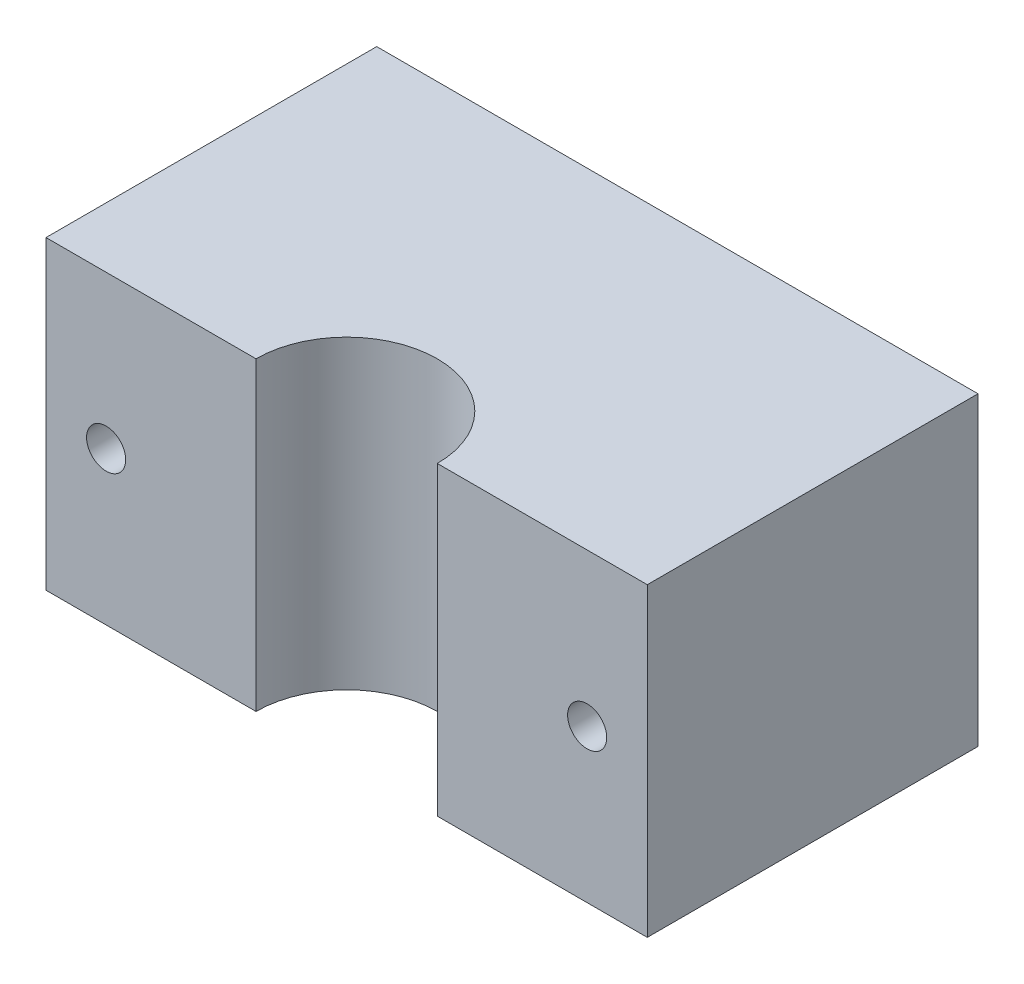
ISO-10303-21;
HEADER;
FILE_DESCRIPTION(('STEP AP214'),'2;1');
FILE_NAME('part.step','',(''),(''),'','','');
FILE_SCHEMA(('AUTOMOTIVE_DESIGN { 1 0 10303 214 1 1 1 1 }'));
ENDSEC;
DATA;
#1=APPLICATION_CONTEXT('core data for automotive mechanical design processes');
#2=APPLICATION_PROTOCOL_DEFINITION('international standard','automotive_design',2000,#1);
#3=PRODUCT_CONTEXT('',#1,'mechanical');
#4=PRODUCT('Part','Part','',(#3));
#5=PRODUCT_RELATED_PRODUCT_CATEGORY('part','',(#4));
#6=PRODUCT_DEFINITION_FORMATION('','',#4);
#7=PRODUCT_DEFINITION_CONTEXT('part definition',#1,'design');
#8=PRODUCT_DEFINITION('design','',#6,#7);
#9=PRODUCT_DEFINITION_SHAPE('','',#8);
#10=(LENGTH_UNIT() NAMED_UNIT(*) SI_UNIT(.MILLI.,.METRE.));
#11=(NAMED_UNIT(*) PLANE_ANGLE_UNIT() SI_UNIT($,.RADIAN.));
#12=(NAMED_UNIT(*) SI_UNIT($,.STERADIAN.) SOLID_ANGLE_UNIT());
#13=UNCERTAINTY_MEASURE_WITH_UNIT(LENGTH_MEASURE(1.E-05),#10,'distance_accuracy_value','');
#14=(GEOMETRIC_REPRESENTATION_CONTEXT(3) GLOBAL_UNCERTAINTY_ASSIGNED_CONTEXT((#13)) GLOBAL_UNIT_ASSIGNED_CONTEXT((#10,
#11,#12)) REPRESENTATION_CONTEXT('',''));
#15=CARTESIAN_POINT('',(0.,0.,0.));
#16=DIRECTION('',(0.,0.,1.));
#17=DIRECTION('',(1.,0.,0.));
#18=AXIS2_PLACEMENT_3D('',#15,#16,#17);
#19=CARTESIAN_POINT('',(64.4387499824699,0.,109.99999999995));
#20=DIRECTION('',(0.,0.,1.));
#21=DIRECTION('',(1.,0.,0.));
#22=AXIS2_PLACEMENT_3D('',#19,#20,#21);
#23=PLANE('',#22);
#24=CARTESIAN_POINT('',(80.,0.,109.99999999995));
#25=DIRECTION('',(0.,0.,-1.));
#26=DIRECTION('',(-1.,0.,0.));
#27=AXIS2_PLACEMENT_3D('',#24,#25,#26);
#28=CIRCLE('',#27,6.5);
#29=CARTESIAN_POINT('',(73.5,0.,109.99999999995));
#30=VERTEX_POINT('',#29);
#31=EDGE_CURVE('E121',#30,#30,#28,.T.);
#32=ORIENTED_EDGE('',*,*,#31,.T.);
#33=EDGE_LOOP('',(#32));
#34=FACE_BOUND('',#33,.T.);
#35=DIRECTION('',(1.,0.,0.));
#36=VECTOR('',#35,1.);
#37=CARTESIAN_POINT('',(-24.4387499824699,50.8,109.99999999995));
#38=LINE('',#37,#36);
#39=CARTESIAN_POINT('',(30.15,50.8,109.999999999949));
#40=VERTEX_POINT('',#39);
#41=CARTESIAN_POINT('',(100.,50.8,109.999999999951));
#42=VERTEX_POINT('',#41);
#43=EDGE_CURVE('E95',#40,#42,#38,.T.);
#44=ORIENTED_EDGE('',*,*,#43,.F.);
#45=DIRECTION('',(0.,1.,0.));
#46=VECTOR('',#45,1.);
#47=CARTESIAN_POINT('',(30.15,-684.295658325961,109.999999999951));
#48=LINE('',#47,#46);
#49=CARTESIAN_POINT('',(30.15,-50.8,109.999999999951));
#50=VERTEX_POINT('',#49);
#51=EDGE_CURVE('E37',#50,#40,#48,.T.);
#52=ORIENTED_EDGE('',*,*,#51,.F.);
#53=DIRECTION('',(-1.,0.,0.));
#54=VECTOR('',#53,1.);
#55=CARTESIAN_POINT('',(-24.4387499824699,-50.8,109.99999999995));
#56=LINE('',#55,#54);
#57=CARTESIAN_POINT('',(100.,-50.8,109.999999999951));
#58=VERTEX_POINT('',#57);
#59=EDGE_CURVE('E161',#58,#50,#56,.T.);
#60=ORIENTED_EDGE('',*,*,#59,.F.);
#61=DIRECTION('',(0.,-1.,0.));
#62=VECTOR('',#61,1.);
#63=CARTESIAN_POINT('',(100.,0.,109.999999999951));
#64=LINE('',#63,#62);
#65=EDGE_CURVE('E28',#42,#58,#64,.T.);
#66=ORIENTED_EDGE('',*,*,#65,.F.);
#67=EDGE_LOOP('',(#44,#52,#60,#66));
#68=FACE_BOUND('',#67,.T.);
#69=ADVANCED_FACE('F18',(#34,#68),#23,.T.);
#70=CARTESIAN_POINT('',(-80.,0.,109.999999999951));
#71=DIRECTION('',(0.,0.,-1.));
#72=DIRECTION('',(-1.,0.,0.));
#73=AXIS2_PLACEMENT_3D('',#70,#71,#72);
#74=CIRCLE('',#73,6.5);
#75=CARTESIAN_POINT('',(-86.5,0.,109.999999999951));
#76=VERTEX_POINT('',#75);
#77=EDGE_CURVE('E120',#76,#76,#74,.T.);
#78=ORIENTED_EDGE('',*,*,#77,.T.);
#79=EDGE_LOOP('',(#78));
#80=FACE_BOUND('',#79,.T.);
#81=CARTESIAN_POINT('',(-30.15,-50.8,109.99999999995));
#82=VERTEX_POINT('',#81);
#83=CARTESIAN_POINT('',(-100.,-50.8,109.999999999951));
#84=VERTEX_POINT('',#83);
#85=EDGE_CURVE('E89',#82,#84,#56,.T.);
#86=ORIENTED_EDGE('',*,*,#85,.F.);
#87=DIRECTION('',(0.,1.,0.));
#88=VECTOR('',#87,1.);
#89=CARTESIAN_POINT('',(-30.15,-684.295658325961,109.99999999995));
#90=LINE('',#89,#88);
#91=CARTESIAN_POINT('',(-30.15,50.8,109.99999999995));
#92=VERTEX_POINT('',#91);
#93=EDGE_CURVE('E79',#82,#92,#90,.T.);
#94=ORIENTED_EDGE('',*,*,#93,.T.);
#95=CARTESIAN_POINT('',(-100.,50.8,109.999999999951));
#96=VERTEX_POINT('',#95);
#97=EDGE_CURVE('E88',#96,#92,#38,.T.);
#98=ORIENTED_EDGE('',*,*,#97,.F.);
#99=DIRECTION('',(0.,-1.,0.));
#100=VECTOR('',#99,1.);
#101=CARTESIAN_POINT('',(-100.,0.,109.999999999951));
#102=LINE('',#101,#100);
#103=EDGE_CURVE('E94',#96,#84,#102,.T.);
#104=ORIENTED_EDGE('',*,*,#103,.T.);
#105=EDGE_LOOP('',(#86,#94,#98,#104));
#106=FACE_BOUND('',#105,.T.);
#107=ADVANCED_FACE('F86',(#80,#106),#23,.T.);
#108=CARTESIAN_POINT('',(0.45259243226603,50.8,51.7365175647828));
#109=DIRECTION('',(0.,-1.,0.));
#110=DIRECTION('',(0.,0.,-1.));
#111=AXIS2_PLACEMENT_3D('',#108,#109,#110);
#112=PLANE('',#111);
#113=CARTESIAN_POINT('',(0.,50.8,109.999999999951));
#114=DIRECTION('',(0.,-1.,0.));
#115=DIRECTION('',(-1.,0.,0.));
#116=AXIS2_PLACEMENT_3D('',#113,#114,#115);
#117=CIRCLE('',#116,30.15);
#118=EDGE_CURVE('E76',#92,#40,#117,.T.);
#119=ORIENTED_EDGE('',*,*,#118,.T.);
#120=ORIENTED_EDGE('',*,*,#43,.T.);
#121=DIRECTION('',(0.,0.,-1.));
#122=VECTOR('',#121,1.);
#123=CARTESIAN_POINT('',(100.,50.8,0.));
#124=LINE('',#123,#122);
#125=CARTESIAN_POINT('',(100.,50.8,-5.1986193128073E-11));
#126=VERTEX_POINT('',#125);
#127=EDGE_CURVE('E55',#42,#126,#124,.T.);
#128=ORIENTED_EDGE('',*,*,#127,.T.);
#129=DIRECTION('',(-1.,0.,0.));
#130=VECTOR('',#129,1.);
#131=CARTESIAN_POINT('',(-100.,50.8,-5.1986193128073E-11));
#132=LINE('',#131,#130);
#133=CARTESIAN_POINT('',(-100.,50.8,-5.1986193128073E-11));
#134=VERTEX_POINT('',#133);
#135=EDGE_CURVE('E22',#126,#134,#132,.T.);
#136=ORIENTED_EDGE('',*,*,#135,.T.);
#137=DIRECTION('',(0.,0.,1.));
#138=VECTOR('',#137,1.);
#139=CARTESIAN_POINT('',(-100.,50.8,109.999999999951));
#140=LINE('',#139,#138);
#141=EDGE_CURVE('E64',#134,#96,#140,.T.);
#142=ORIENTED_EDGE('',*,*,#141,.T.);
#143=ORIENTED_EDGE('',*,*,#97,.T.);
#144=EDGE_LOOP('',(#119,#120,#128,#136,#142,#143));
#145=FACE_BOUND('',#144,.T.);
#146=ADVANCED_FACE('F92',(#145),#112,.F.);
#147=CARTESIAN_POINT('',(100.,0.,109.999999999951));
#148=DIRECTION('',(1.,0.,0.));
#149=DIRECTION('',(0.,0.,-1.));
#150=AXIS2_PLACEMENT_3D('',#147,#148,#149);
#151=PLANE('',#150);
#152=DIRECTION('',(0.,-1.,0.));
#153=VECTOR('',#152,1.);
#154=CARTESIAN_POINT('',(100.,0.,-5.1986193128073E-11));
#155=LINE('',#154,#153);
#156=CARTESIAN_POINT('',(100.,-50.8,-5.1986193128073E-11));
#157=VERTEX_POINT('',#156);
#158=EDGE_CURVE('E132',#126,#157,#155,.T.);
#159=ORIENTED_EDGE('',*,*,#158,.F.);
#160=ORIENTED_EDGE('',*,*,#127,.F.);
#161=ORIENTED_EDGE('',*,*,#65,.T.);
#162=DIRECTION('',(0.,0.,1.));
#163=VECTOR('',#162,1.);
#164=CARTESIAN_POINT('',(100.,-50.8,0.));
#165=LINE('',#164,#163);
#166=EDGE_CURVE('E105',#157,#58,#165,.T.);
#167=ORIENTED_EDGE('',*,*,#166,.F.);
#168=EDGE_LOOP('',(#159,#160,#161,#167));
#169=FACE_BOUND('',#168,.T.);
#170=ADVANCED_FACE('F155',(#169),#151,.T.);
#171=CARTESIAN_POINT('',(100.,0.,-5.1986193128073E-11));
#172=DIRECTION('',(0.,0.,-1.));
#173=DIRECTION('',(-1.,0.,0.));
#174=AXIS2_PLACEMENT_3D('',#171,#172,#173);
#175=PLANE('',#174);
#176=CARTESIAN_POINT('',(-80.0000000000021,0.,-4.92696161646933E-11));
#177=DIRECTION('',(0.,0.,1.));
#178=DIRECTION('',(-1.,0.,0.));
#179=AXIS2_PLACEMENT_3D('',#176,#177,#178);
#180=CIRCLE('',#179,6.5);
#181=CARTESIAN_POINT('',(-86.5000000000021,0.,-4.91716473935506E-11));
#182=VERTEX_POINT('',#181);
#183=EDGE_CURVE('E116',#182,#182,#180,.T.);
#184=ORIENTED_EDGE('',*,*,#183,.T.);
#185=EDGE_LOOP('',(#184));
#186=FACE_BOUND('',#185,.T.);
#187=CARTESIAN_POINT('',(79.9999999999977,0.,-5.1684351243253E-11));
#188=DIRECTION('',(0.,0.,1.));
#189=DIRECTION('',(-1.,0.,0.));
#190=AXIS2_PLACEMENT_3D('',#187,#188,#189);
#191=CIRCLE('',#190,6.5);
#192=CARTESIAN_POINT('',(73.4999999999977,0.,-5.15863824721103E-11));
#193=VERTEX_POINT('',#192);
#194=EDGE_CURVE('E90',#193,#193,#191,.T.);
#195=ORIENTED_EDGE('',*,*,#194,.T.);
#196=EDGE_LOOP('',(#195));
#197=FACE_BOUND('',#196,.T.);
#198=DIRECTION('',(0.,-1.,0.));
#199=VECTOR('',#198,1.);
#200=CARTESIAN_POINT('',(-100.,0.,-5.1986193128073E-11));
#201=LINE('',#200,#199);
#202=CARTESIAN_POINT('',(-100.,-50.8,-5.1986193128073E-11));
#203=VERTEX_POINT('',#202);
#204=EDGE_CURVE('E125',#134,#203,#201,.T.);
#205=ORIENTED_EDGE('',*,*,#204,.F.);
#206=ORIENTED_EDGE('',*,*,#135,.F.);
#207=ORIENTED_EDGE('',*,*,#158,.T.);
#208=DIRECTION('',(1.,0.,0.));
#209=VECTOR('',#208,1.);
#210=CARTESIAN_POINT('',(-100.,-50.8,-5.1986193128073E-11));
#211=LINE('',#210,#209);
#212=EDGE_CURVE('E128',#203,#157,#211,.T.);
#213=ORIENTED_EDGE('',*,*,#212,.F.);
#214=EDGE_LOOP('',(#205,#206,#207,#213));
#215=FACE_BOUND('',#214,.T.);
#216=ADVANCED_FACE('F20',(#186,#197,#215),#175,.T.);
#217=CARTESIAN_POINT('',(-100.,0.,0.));
#218=DIRECTION('',(-1.,0.,0.));
#219=DIRECTION('',(0.,0.,1.));
#220=AXIS2_PLACEMENT_3D('',#217,#218,#219);
#221=PLANE('',#220);
#222=ORIENTED_EDGE('',*,*,#103,.F.);
#223=ORIENTED_EDGE('',*,*,#141,.F.);
#224=ORIENTED_EDGE('',*,*,#204,.T.);
#225=DIRECTION('',(0.,0.,-1.));
#226=VECTOR('',#225,1.);
#227=CARTESIAN_POINT('',(-100.,-50.8,109.999999999951));
#228=LINE('',#227,#226);
#229=EDGE_CURVE('E131',#84,#203,#228,.T.);
#230=ORIENTED_EDGE('',*,*,#229,.F.);
#231=EDGE_LOOP('',(#222,#223,#224,#230));
#232=FACE_BOUND('',#231,.T.);
#233=ADVANCED_FACE('F182',(#232),#221,.T.);
#234=CARTESIAN_POINT('',(0.45259243226603,-50.8,51.7365175647828));
#235=DIRECTION('',(0.,-1.,0.));
#236=DIRECTION('',(0.,0.,-1.));
#237=AXIS2_PLACEMENT_3D('',#234,#235,#236);
#238=PLANE('',#237);
#239=ORIENTED_EDGE('',*,*,#59,.T.);
#240=CARTESIAN_POINT('',(0.,-50.8,109.999999999951));
#241=DIRECTION('',(0.,-1.,0.));
#242=DIRECTION('',(0.,0.,-1.));
#243=AXIS2_PLACEMENT_3D('',#240,#241,#242);
#244=CIRCLE('',#243,30.15);
#245=EDGE_CURVE('E11',#50,#82,#244,.F.);
#246=ORIENTED_EDGE('',*,*,#245,.T.);
#247=ORIENTED_EDGE('',*,*,#85,.T.);
#248=ORIENTED_EDGE('',*,*,#229,.T.);
#249=ORIENTED_EDGE('',*,*,#212,.T.);
#250=ORIENTED_EDGE('',*,*,#166,.T.);
#251=EDGE_LOOP('',(#239,#246,#247,#248,#249,#250));
#252=FACE_BOUND('',#251,.T.);
#253=ADVANCED_FACE('F169',(#252),#238,.T.);
#254=CARTESIAN_POINT('',(-80.,0.,109.999999999951));
#255=DIRECTION('',(0.,0.,-1.));
#256=DIRECTION('',(-1.,0.,0.));
#257=AXIS2_PLACEMENT_3D('',#254,#255,#256);
#258=CYLINDRICAL_SURFACE('',#257,6.5);
#259=ORIENTED_EDGE('',*,*,#77,.F.);
#260=EDGE_LOOP('',(#259));
#261=FACE_BOUND('',#260,.T.);
#262=ORIENTED_EDGE('',*,*,#183,.F.);
#263=EDGE_LOOP('',(#262));
#264=FACE_BOUND('',#263,.T.);
#265=ADVANCED_FACE('F257',(#261,#264),#258,.F.);
#266=CARTESIAN_POINT('',(80.,0.,109.999999999949));
#267=DIRECTION('',(0.,0.,-1.));
#268=DIRECTION('',(-1.,0.,0.));
#269=AXIS2_PLACEMENT_3D('',#266,#267,#268);
#270=CYLINDRICAL_SURFACE('',#269,6.5);
#271=ORIENTED_EDGE('',*,*,#31,.F.);
#272=EDGE_LOOP('',(#271));
#273=FACE_BOUND('',#272,.T.);
#274=ORIENTED_EDGE('',*,*,#194,.F.);
#275=EDGE_LOOP('',(#274));
#276=FACE_BOUND('',#275,.T.);
#277=ADVANCED_FACE('F268',(#273,#276),#270,.F.);
#278=CARTESIAN_POINT('',(0.,-684.295658325961,109.999999999951));
#279=DIRECTION('',(0.,1.,0.));
#280=DIRECTION('',(0.,0.,1.));
#281=AXIS2_PLACEMENT_3D('',#278,#279,#280);
#282=CYLINDRICAL_SURFACE('',#281,30.15);
#283=ORIENTED_EDGE('',*,*,#51,.T.);
#284=ORIENTED_EDGE('',*,*,#118,.F.);
#285=ORIENTED_EDGE('',*,*,#93,.F.);
#286=ORIENTED_EDGE('',*,*,#245,.F.);
#287=EDGE_LOOP('',(#283,#284,#285,#286));
#288=FACE_BOUND('',#287,.T.);
#289=ADVANCED_FACE('F78',(#288),#282,.F.);
#290=CLOSED_SHELL('',(#69,#107,#146,#170,#216,#233,#253,#265,#277,#289));
#291=MANIFOLD_SOLID_BREP('B1',#290);
#292=ADVANCED_BREP_SHAPE_REPRESENTATION('',(#18,#291),#14);
#293=SHAPE_DEFINITION_REPRESENTATION(#9,#292);
ENDSEC;
END-ISO-10303-21;
